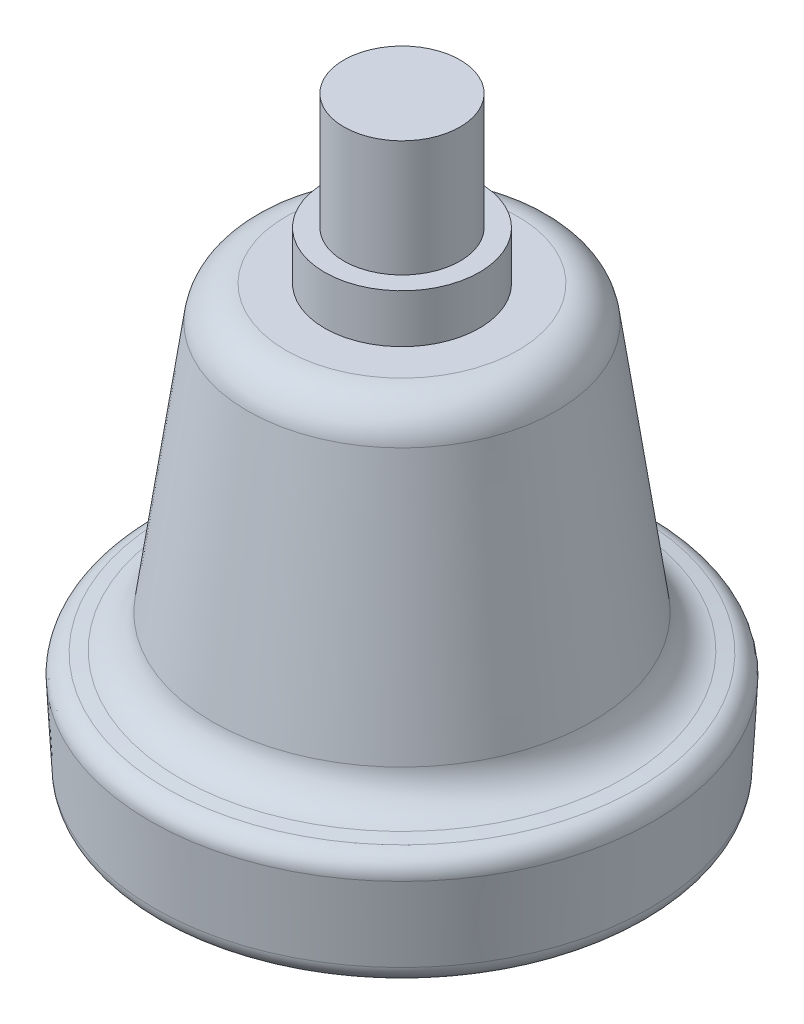
ISO-10303-21;
HEADER;
FILE_DESCRIPTION(('STEP AP214'),'2;1');
FILE_NAME('part.step','',(''),(''),'','','');
FILE_SCHEMA(('AUTOMOTIVE_DESIGN { 1 0 10303 214 1 1 1 1 }'));
ENDSEC;
DATA;
#1=APPLICATION_CONTEXT('core data for automotive mechanical design processes');
#2=APPLICATION_PROTOCOL_DEFINITION('international standard','automotive_design',2000,#1);
#3=PRODUCT_CONTEXT('',#1,'mechanical');
#4=PRODUCT('Part','Part','',(#3));
#5=PRODUCT_RELATED_PRODUCT_CATEGORY('part','',(#4));
#6=PRODUCT_DEFINITION_FORMATION('','',#4);
#7=PRODUCT_DEFINITION_CONTEXT('part definition',#1,'design');
#8=PRODUCT_DEFINITION('design','',#6,#7);
#9=PRODUCT_DEFINITION_SHAPE('','',#8);
#10=(LENGTH_UNIT() NAMED_UNIT(*) SI_UNIT(.MILLI.,.METRE.));
#11=(NAMED_UNIT(*) PLANE_ANGLE_UNIT() SI_UNIT($,.RADIAN.));
#12=(NAMED_UNIT(*) SI_UNIT($,.STERADIAN.) SOLID_ANGLE_UNIT());
#13=UNCERTAINTY_MEASURE_WITH_UNIT(LENGTH_MEASURE(1.E-05),#10,'distance_accuracy_value','');
#14=(GEOMETRIC_REPRESENTATION_CONTEXT(3) GLOBAL_UNCERTAINTY_ASSIGNED_CONTEXT((#13)) GLOBAL_UNIT_ASSIGNED_CONTEXT((#10,
#11,#12)) REPRESENTATION_CONTEXT('',''));
#15=CARTESIAN_POINT('',(0.,0.,0.));
#16=DIRECTION('',(0.,0.,1.));
#17=DIRECTION('',(1.,0.,0.));
#18=AXIS2_PLACEMENT_3D('',#15,#16,#17);
#19=CARTESIAN_POINT('',(0.,-5.,-11.9775471477105));
#20=DIRECTION('',(0.,-1.,0.));
#21=DIRECTION('',(0.,0.,-1.));
#22=AXIS2_PLACEMENT_3D('',#19,#20,#21);
#23=PLANE('',#22);
#24=CARTESIAN_POINT('',(0.,-5.,0.));
#25=DIRECTION('',(0.,1.,0.));
#26=DIRECTION('',(0.,0.,1.));
#27=AXIS2_PLACEMENT_3D('',#24,#25,#26);
#28=CIRCLE('',#27,8.00000000000001);
#29=CARTESIAN_POINT('',(0.,-5.,8.00000000000001));
#30=VERTEX_POINT('',#29);
#31=EDGE_CURVE('E10',#30,#30,#28,.T.);
#32=ORIENTED_EDGE('',*,*,#31,.F.);
#33=EDGE_LOOP('',(#32));
#34=FACE_BOUND('',#33,.T.);
#35=CARTESIAN_POINT('',(0.,-5.,0.));
#36=DIRECTION('',(0.,1.,0.));
#37=DIRECTION('',(0.,0.,1.));
#38=AXIS2_PLACEMENT_3D('',#35,#36,#37);
#39=CIRCLE('',#38,11.9775471477105);
#40=CARTESIAN_POINT('',(0.,-5.,11.9775471477105));
#41=VERTEX_POINT('',#40);
#42=EDGE_CURVE('E76',#41,#41,#39,.T.);
#43=ORIENTED_EDGE('',*,*,#42,.T.);
#44=EDGE_LOOP('',(#43));
#45=FACE_BOUND('',#44,.T.);
#46=ADVANCED_FACE('F36',(#34,#45),#23,.F.);
#47=CARTESIAN_POINT('',(0.,12.,0.));
#48=DIRECTION('',(0.,1.,0.));
#49=DIRECTION('',(0.,0.,1.));
#50=AXIS2_PLACEMENT_3D('',#47,#48,#49);
#51=CYLINDRICAL_SURFACE('',#50,8.00000000000001);
#52=CARTESIAN_POINT('',(0.,0.,0.));
#53=DIRECTION('',(0.,1.,0.));
#54=DIRECTION('',(0.,0.,1.));
#55=AXIS2_PLACEMENT_3D('',#52,#53,#54);
#56=CIRCLE('',#55,8.00000000000001);
#57=CARTESIAN_POINT('',(0.,0.,8.00000000000001));
#58=VERTEX_POINT('',#57);
#59=EDGE_CURVE('E42',#58,#58,#56,.T.);
#60=ORIENTED_EDGE('',*,*,#59,.F.);
#61=EDGE_LOOP('',(#60));
#62=FACE_BOUND('',#61,.T.);
#63=ORIENTED_EDGE('',*,*,#31,.T.);
#64=EDGE_LOOP('',(#63));
#65=FACE_BOUND('',#64,.T.);
#66=ADVANCED_FACE('F134',(#62,#65),#51,.T.);
#67=CARTESIAN_POINT('',(0.,0.,-8.));
#68=DIRECTION('',(0.,-1.,0.));
#69=DIRECTION('',(0.,0.,-1.));
#70=AXIS2_PLACEMENT_3D('',#67,#68,#69);
#71=PLANE('',#70);
#72=CARTESIAN_POINT('',(0.,0.,0.));
#73=DIRECTION('',(0.,1.,0.));
#74=DIRECTION('',(0.,0.,1.));
#75=AXIS2_PLACEMENT_3D('',#72,#73,#74);
#76=CIRCLE('',#75,6.00000000000001);
#77=CARTESIAN_POINT('',(0.,0.,6.00000000000001));
#78=VERTEX_POINT('',#77);
#79=EDGE_CURVE('E46',#78,#78,#76,.T.);
#80=ORIENTED_EDGE('',*,*,#79,.F.);
#81=EDGE_LOOP('',(#80));
#82=FACE_BOUND('',#81,.T.);
#83=ORIENTED_EDGE('',*,*,#59,.T.);
#84=EDGE_LOOP('',(#83));
#85=FACE_BOUND('',#84,.T.);
#86=ADVANCED_FACE('F139',(#82,#85),#71,.F.);
#87=CARTESIAN_POINT('',(0.,12.,0.));
#88=DIRECTION('',(0.,1.,0.));
#89=DIRECTION('',(0.,0.,1.));
#90=AXIS2_PLACEMENT_3D('',#87,#88,#89);
#91=CYLINDRICAL_SURFACE('',#90,6.);
#92=CARTESIAN_POINT('',(0.,12.,0.));
#93=DIRECTION('',(0.,1.,0.));
#94=DIRECTION('',(0.,0.,1.));
#95=AXIS2_PLACEMENT_3D('',#92,#93,#94);
#96=CIRCLE('',#95,6.);
#97=CARTESIAN_POINT('',(0.,12.,6.00000000000001));
#98=VERTEX_POINT('',#97);
#99=EDGE_CURVE('E50',#98,#98,#96,.T.);
#100=ORIENTED_EDGE('',*,*,#99,.F.);
#101=EDGE_LOOP('',(#100));
#102=FACE_BOUND('',#101,.T.);
#103=ORIENTED_EDGE('',*,*,#79,.T.);
#104=EDGE_LOOP('',(#103));
#105=FACE_BOUND('',#104,.T.);
#106=ADVANCED_FACE('F130',(#102,#105),#91,.T.);
#107=CARTESIAN_POINT('',(0.,12.,-5.99999999999999));
#108=DIRECTION('',(0.,-1.,0.));
#109=DIRECTION('',(0.,0.,-1.));
#110=AXIS2_PLACEMENT_3D('',#107,#108,#109);
#111=PLANE('',#110);
#112=ORIENTED_EDGE('',*,*,#99,.T.);
#113=EDGE_LOOP('',(#112));
#114=FACE_BOUND('',#113,.T.);
#115=ADVANCED_FACE('F125',(#114),#111,.F.);
#116=CARTESIAN_POINT('',(0.,-50.,0.));
#117=DIRECTION('',(0.,1.,0.));
#118=DIRECTION('',(0.,0.,1.));
#119=AXIS2_PLACEMENT_3D('',#116,#117,#118);
#120=PLANE('',#119);
#121=CARTESIAN_POINT('',(0.,-50.,0.));
#122=DIRECTION('',(0.,1.,0.));
#123=DIRECTION('',(0.,0.,1.));
#124=AXIS2_PLACEMENT_3D('',#121,#122,#123);
#125=CIRCLE('',#124,23.5807377657357);
#126=CARTESIAN_POINT('',(0.,-50.,23.5807377657357));
#127=VERTEX_POINT('',#126);
#128=EDGE_CURVE('E55',#127,#127,#125,.T.);
#129=ORIENTED_EDGE('',*,*,#128,.F.);
#130=EDGE_LOOP('',(#129));
#131=FACE_BOUND('',#130,.T.);
#132=ADVANCED_FACE('F120',(#131),#120,.F.);
#133=CARTESIAN_POINT('',(0.,-48.,0.));
#134=DIRECTION('',(0.,1.,0.));
#135=DIRECTION('',(0.,0.,1.));
#136=AXIS2_PLACEMENT_3D('',#133,#134,#135);
#137=TOROIDAL_SURFACE('',#136,23.5807377657357,2.00000000000001);
#138=CARTESIAN_POINT('',(0.,-48.1046719124859,0.));
#139=DIRECTION('',(0.,1.,0.));
#140=DIRECTION('',(0.,0.,1.));
#141=AXIS2_PLACEMENT_3D('',#138,#139,#140);
#142=CIRCLE('',#141,25.5779968352449);
#143=CARTESIAN_POINT('',(0.,-48.1046719124859,25.5779968352449));
#144=VERTEX_POINT('',#143);
#145=EDGE_CURVE('E58',#144,#144,#142,.T.);
#146=ORIENTED_EDGE('',*,*,#145,.F.);
#147=EDGE_LOOP('',(#146));
#148=FACE_BOUND('',#147,.T.);
#149=ORIENTED_EDGE('',*,*,#128,.T.);
#150=EDGE_LOOP('',(#149));
#151=FACE_BOUND('',#150,.T.);
#152=ADVANCED_FACE('F114',(#148,#151),#137,.T.);
#153=CARTESIAN_POINT('',(0.,-48.1046719124859,0.));
#154=DIRECTION('',(0.,1.,0.));
#155=DIRECTION('',(0.,0.,1.));
#156=AXIS2_PLACEMENT_3D('',#153,#154,#155);
#157=CONICAL_SURFACE('',#156,25.5779968352449,0.0523598775598222);
#158=CARTESIAN_POINT('',(0.,-40.1046719124859,0.));
#159=DIRECTION('',(0.,1.,0.));
#160=DIRECTION('',(0.,0.,1.));
#161=AXIS2_PLACEMENT_3D('',#158,#159,#160);
#162=CIRCLE('',#161,25.9972590695092);
#163=CARTESIAN_POINT('',(0.,-40.1046719124859,25.9972590695092));
#164=VERTEX_POINT('',#163);
#165=EDGE_CURVE('E61',#164,#164,#162,.T.);
#166=ORIENTED_EDGE('',*,*,#165,.F.);
#167=EDGE_LOOP('',(#166));
#168=FACE_BOUND('',#167,.T.);
#169=ORIENTED_EDGE('',*,*,#145,.T.);
#170=EDGE_LOOP('',(#169));
#171=FACE_BOUND('',#170,.T.);
#172=ADVANCED_FACE('F108',(#168,#171),#157,.T.);
#173=CARTESIAN_POINT('',(0.,-40.,0.));
#174=DIRECTION('',(0.,1.,0.));
#175=DIRECTION('',(0.,0.,1.));
#176=AXIS2_PLACEMENT_3D('',#173,#174,#175);
#177=TOROIDAL_SURFACE('',#176,24.,2.00000000000001);
#178=CARTESIAN_POINT('',(0.,-38.0246233188097,0.));
#179=DIRECTION('',(0.,1.,0.));
#180=DIRECTION('',(0.,0.,1.));
#181=AXIS2_PLACEMENT_3D('',#178,#179,#180);
#182=CIRCLE('',#181,24.3128689300805);
#183=CARTESIAN_POINT('',(0.,-38.0246233188097,24.3128689300805));
#184=VERTEX_POINT('',#183);
#185=EDGE_CURVE('E64',#184,#184,#182,.T.);
#186=ORIENTED_EDGE('',*,*,#185,.F.);
#187=EDGE_LOOP('',(#186));
#188=FACE_BOUND('',#187,.T.);
#189=ORIENTED_EDGE('',*,*,#165,.T.);
#190=EDGE_LOOP('',(#189));
#191=FACE_BOUND('',#190,.T.);
#192=ADVANCED_FACE('F102',(#188,#191),#177,.T.);
#193=CARTESIAN_POINT('',(0.,-38.0246233188097,0.));
#194=DIRECTION('',(0.,-1.,0.));
#195=DIRECTION('',(0.,0.,-1.));
#196=AXIS2_PLACEMENT_3D('',#193,#194,#195);
#197=CONICAL_SURFACE('',#196,24.3128689300805,1.41371669411541);
#198=CARTESIAN_POINT('',(0.,-37.8045536468166,0.));
#199=DIRECTION('',(0.,1.,0.));
#200=DIRECTION('',(0.,0.,1.));
#201=AXIS2_PLACEMENT_3D('',#198,#199,#200);
#202=CIRCLE('',#201,22.9234037051996);
#203=CARTESIAN_POINT('',(0.,-37.8045536468166,22.9234037051996));
#204=VERTEX_POINT('',#203);
#205=EDGE_CURVE('E67',#204,#204,#202,.T.);
#206=ORIENTED_EDGE('',*,*,#205,.F.);
#207=EDGE_LOOP('',(#206));
#208=FACE_BOUND('',#207,.T.);
#209=ORIENTED_EDGE('',*,*,#185,.T.);
#210=EDGE_LOOP('',(#209));
#211=FACE_BOUND('',#210,.T.);
#212=ADVANCED_FACE('F96',(#208,#211),#197,.T.);
#213=CARTESIAN_POINT('',(0.,-33.853800284436,0.));
#214=DIRECTION('',(0.,1.,0.));
#215=DIRECTION('',(0.,0.,1.));
#216=AXIS2_PLACEMENT_3D('',#213,#214,#215);
#217=TOROIDAL_SURFACE('',#216,23.5491415653605,4.);
#218=CARTESIAN_POINT('',(0.,-34.4104926882762,0.));
#219=DIRECTION('',(0.,1.,0.));
#220=DIRECTION('',(0.,0.,1.));
#221=AXIS2_PLACEMENT_3D('',#218,#219,#220);
#222=CIRCLE('',#221,19.5880692903942);
#223=CARTESIAN_POINT('',(0.,-34.4104926882762,19.5880692903942));
#224=VERTEX_POINT('',#223);
#225=EDGE_CURVE('E70',#224,#224,#222,.T.);
#226=ORIENTED_EDGE('',*,*,#225,.F.);
#227=EDGE_LOOP('',(#226));
#228=FACE_BOUND('',#227,.T.);
#229=ORIENTED_EDGE('',*,*,#205,.T.);
#230=EDGE_LOOP('',(#229));
#231=FACE_BOUND('',#230,.T.);
#232=ADVANCED_FACE('F90',(#228,#231),#217,.F.);
#233=CARTESIAN_POINT('',(0.,-34.4104926882762,0.));
#234=DIRECTION('',(0.,-1.,0.));
#235=DIRECTION('',(0.,0.,-1.));
#236=AXIS2_PLACEMENT_3D('',#233,#234,#235);
#237=CONICAL_SURFACE('',#236,19.5880692903942,0.13962634015954);
#238=CARTESIAN_POINT('',(0.,-8.44330759615976,0.));
#239=DIRECTION('',(0.,1.,0.));
#240=DIRECTION('',(0.,0.,1.));
#241=AXIS2_PLACEMENT_3D('',#238,#239,#240);
#242=CIRCLE('',#241,15.9386194226768);
#243=CARTESIAN_POINT('',(0.,-8.44330759615977,15.9386194226768));
#244=VERTEX_POINT('',#243);
#245=EDGE_CURVE('E73',#244,#244,#242,.T.);
#246=ORIENTED_EDGE('',*,*,#245,.F.);
#247=EDGE_LOOP('',(#246));
#248=FACE_BOUND('',#247,.T.);
#249=ORIENTED_EDGE('',*,*,#225,.T.);
#250=EDGE_LOOP('',(#249));
#251=FACE_BOUND('',#250,.T.);
#252=ADVANCED_FACE('F84',(#248,#251),#237,.T.);
#253=CARTESIAN_POINT('',(0.,-9.,0.));
#254=DIRECTION('',(0.,1.,0.));
#255=DIRECTION('',(0.,0.,1.));
#256=AXIS2_PLACEMENT_3D('',#253,#254,#255);
#257=TOROIDAL_SURFACE('',#256,11.9775471477105,4.);
#258=ORIENTED_EDGE('',*,*,#42,.F.);
#259=EDGE_LOOP('',(#258));
#260=FACE_BOUND('',#259,.T.);
#261=ORIENTED_EDGE('',*,*,#245,.T.);
#262=EDGE_LOOP('',(#261));
#263=FACE_BOUND('',#262,.T.);
#264=ADVANCED_FACE('F81',(#260,#263),#257,.T.);
#265=CLOSED_SHELL('',(#46,#66,#86,#106,#115,#132,#152,#172,#192,#212,#232,#252,#264));
#266=MANIFOLD_SOLID_BREP('B2',#265);
#267=ADVANCED_BREP_SHAPE_REPRESENTATION('',(#18,#266),#14);
#268=SHAPE_DEFINITION_REPRESENTATION(#9,#267);
ENDSEC;
END-ISO-10303-21;
